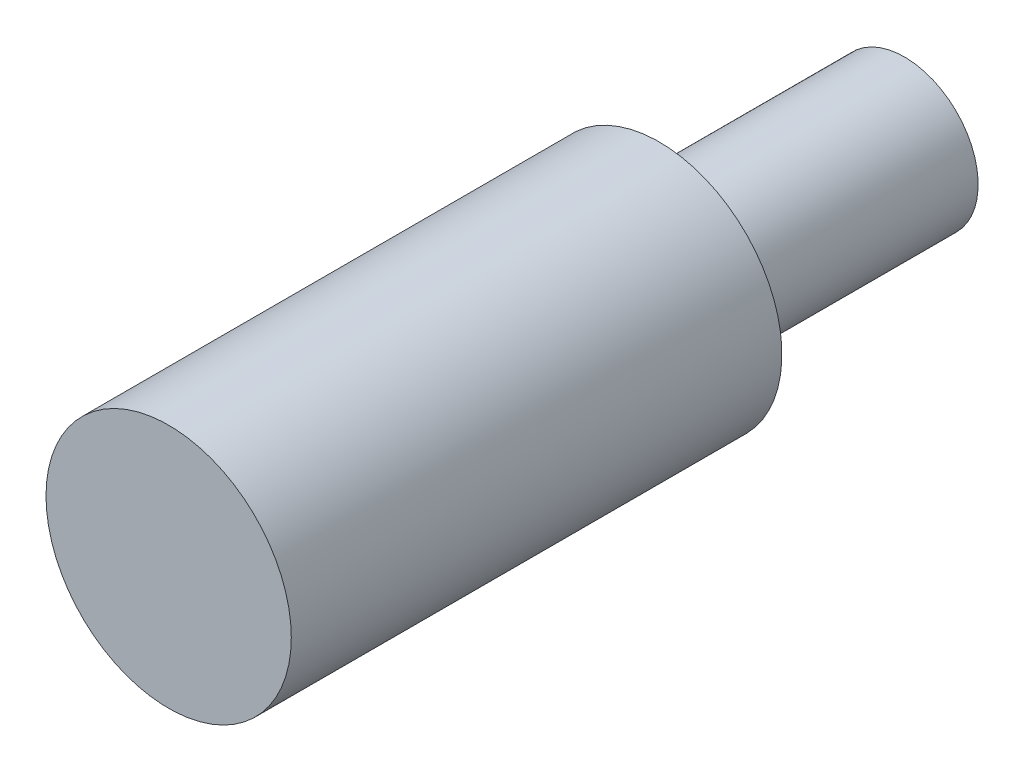
ISO-10303-21;
HEADER;
FILE_DESCRIPTION(('STEP AP214'),'2;1');
FILE_NAME('part.step','',(''),(''),'','','');
FILE_SCHEMA(('AUTOMOTIVE_DESIGN { 1 0 10303 214 1 1 1 1 }'));
ENDSEC;
DATA;
#1=APPLICATION_CONTEXT('core data for automotive mechanical design processes');
#2=APPLICATION_PROTOCOL_DEFINITION('international standard','automotive_design',2000,#1);
#3=PRODUCT_CONTEXT('',#1,'mechanical');
#4=PRODUCT('Part','Part','',(#3));
#5=PRODUCT_RELATED_PRODUCT_CATEGORY('part','',(#4));
#6=PRODUCT_DEFINITION_FORMATION('','',#4);
#7=PRODUCT_DEFINITION_CONTEXT('part definition',#1,'design');
#8=PRODUCT_DEFINITION('design','',#6,#7);
#9=PRODUCT_DEFINITION_SHAPE('','',#8);
#10=(LENGTH_UNIT() NAMED_UNIT(*) SI_UNIT(.MILLI.,.METRE.));
#11=(NAMED_UNIT(*) PLANE_ANGLE_UNIT() SI_UNIT($,.RADIAN.));
#12=(NAMED_UNIT(*) SI_UNIT($,.STERADIAN.) SOLID_ANGLE_UNIT());
#13=UNCERTAINTY_MEASURE_WITH_UNIT(LENGTH_MEASURE(1.E-05),#10,'distance_accuracy_value','');
#14=(GEOMETRIC_REPRESENTATION_CONTEXT(3) GLOBAL_UNCERTAINTY_ASSIGNED_CONTEXT((#13)) GLOBAL_UNIT_ASSIGNED_CONTEXT((#10,
#11,#12)) REPRESENTATION_CONTEXT('',''));
#15=CARTESIAN_POINT('',(0.,0.,0.));
#16=DIRECTION('',(0.,0.,1.));
#17=DIRECTION('',(1.,0.,0.));
#18=AXIS2_PLACEMENT_3D('',#15,#16,#17);
#19=CARTESIAN_POINT('',(0.,14.2080114449213,150.));
#20=DIRECTION('',(0.,0.,-1.));
#21=DIRECTION('',(-1.,0.,0.));
#22=AXIS2_PLACEMENT_3D('',#19,#20,#21);
#23=CYLINDRICAL_SURFACE('',#22,25.);
#24=CARTESIAN_POINT('',(0.,14.2080114449213,150.));
#25=DIRECTION('',(0.,0.,1.));
#26=DIRECTION('',(1.,0.,0.));
#27=AXIS2_PLACEMENT_3D('',#24,#25,#26);
#28=CIRCLE('',#27,25.);
#29=CARTESIAN_POINT('',(25.,14.2080114449213,150.));
#30=VERTEX_POINT('',#29);
#31=EDGE_CURVE('E10',#30,#30,#28,.T.);
#32=ORIENTED_EDGE('',*,*,#31,.F.);
#33=EDGE_LOOP('',(#32));
#34=FACE_BOUND('',#33,.T.);
#35=CARTESIAN_POINT('',(0.,14.2080114449213,50.));
#36=DIRECTION('',(0.,0.,-1.));
#37=DIRECTION('',(-1.,0.,0.));
#38=AXIS2_PLACEMENT_3D('',#35,#36,#37);
#39=CIRCLE('',#38,25.);
#40=CARTESIAN_POINT('',(-25.,14.2080114449213,50.));
#41=VERTEX_POINT('',#40);
#42=EDGE_CURVE('E38',#41,#41,#39,.T.);
#43=ORIENTED_EDGE('',*,*,#42,.F.);
#44=EDGE_LOOP('',(#43));
#45=FACE_BOUND('',#44,.T.);
#46=ADVANCED_FACE('F32',(#34,#45),#23,.T.);
#47=CARTESIAN_POINT('',(0.,14.2080114449213,150.));
#48=DIRECTION('',(0.,0.,1.));
#49=DIRECTION('',(1.,0.,0.));
#50=AXIS2_PLACEMENT_3D('',#47,#48,#49);
#51=PLANE('',#50);
#52=ORIENTED_EDGE('',*,*,#31,.T.);
#53=EDGE_LOOP('',(#52));
#54=FACE_BOUND('',#53,.T.);
#55=ADVANCED_FACE('F63',(#54),#51,.T.);
#56=CARTESIAN_POINT('',(0.,14.2080114449213,50.));
#57=DIRECTION('',(0.,0.,-1.));
#58=DIRECTION('',(-1.,0.,0.));
#59=AXIS2_PLACEMENT_3D('',#56,#57,#58);
#60=PLANE('',#59);
#61=CARTESIAN_POINT('',(0.,14.2080114449213,50.));
#62=DIRECTION('',(0.,0.,-1.));
#63=DIRECTION('',(-1.,0.,0.));
#64=AXIS2_PLACEMENT_3D('',#61,#62,#63);
#65=CIRCLE('',#64,15.);
#66=CARTESIAN_POINT('',(-15.,14.2080114449213,50.));
#67=VERTEX_POINT('',#66);
#68=EDGE_CURVE('E42',#67,#67,#65,.T.);
#69=ORIENTED_EDGE('',*,*,#68,.F.);
#70=EDGE_LOOP('',(#69));
#71=FACE_BOUND('',#70,.T.);
#72=ORIENTED_EDGE('',*,*,#42,.T.);
#73=EDGE_LOOP('',(#72));
#74=FACE_BOUND('',#73,.T.);
#75=ADVANCED_FACE('F56',(#71,#74),#60,.T.);
#76=CARTESIAN_POINT('',(0.,14.2080114449213,50.));
#77=DIRECTION('',(0.,0.,-1.));
#78=DIRECTION('',(-1.,0.,0.));
#79=AXIS2_PLACEMENT_3D('',#76,#77,#78);
#80=CYLINDRICAL_SURFACE('',#79,15.);
#81=ORIENTED_EDGE('',*,*,#68,.T.);
#82=EDGE_LOOP('',(#81));
#83=FACE_BOUND('',#82,.T.);
#84=CARTESIAN_POINT('',(0.,14.2080114449213,0.));
#85=DIRECTION('',(0.,0.,-1.));
#86=DIRECTION('',(-1.,0.,0.));
#87=AXIS2_PLACEMENT_3D('',#84,#85,#86);
#88=CIRCLE('',#87,15.);
#89=CARTESIAN_POINT('',(-15.,14.2080114449213,0.));
#90=VERTEX_POINT('',#89);
#91=EDGE_CURVE('E46',#90,#90,#88,.T.);
#92=ORIENTED_EDGE('',*,*,#91,.F.);
#93=EDGE_LOOP('',(#92));
#94=FACE_BOUND('',#93,.T.);
#95=ADVANCED_FACE('F54',(#83,#94),#80,.T.);
#96=CARTESIAN_POINT('',(0.,14.2080114449213,0.));
#97=DIRECTION('',(0.,0.,1.));
#98=DIRECTION('',(1.,0.,0.));
#99=AXIS2_PLACEMENT_3D('',#96,#97,#98);
#100=PLANE('',#99);
#101=ORIENTED_EDGE('',*,*,#91,.T.);
#102=EDGE_LOOP('',(#101));
#103=FACE_BOUND('',#102,.T.);
#104=ADVANCED_FACE('F52',(#103),#100,.F.);
#105=CLOSED_SHELL('',(#46,#55,#75,#95,#104));
#106=MANIFOLD_SOLID_BREP('B2',#105);
#107=ADVANCED_BREP_SHAPE_REPRESENTATION('',(#18,#106),#14);
#108=SHAPE_DEFINITION_REPRESENTATION(#9,#107);
ENDSEC;
END-ISO-10303-21;
